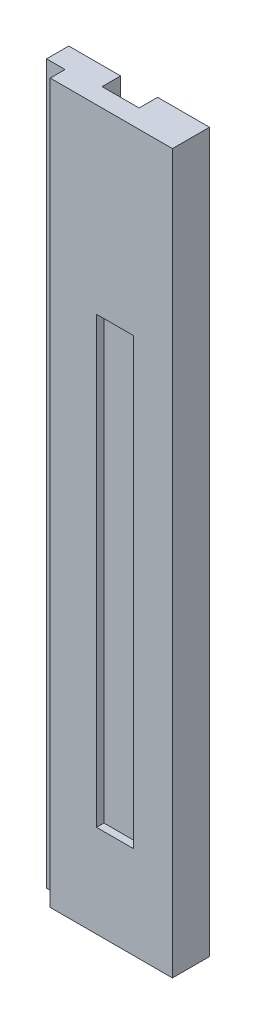
ISO-10303-21;
HEADER;
FILE_DESCRIPTION(('STEP AP214'),'2;1');
FILE_NAME('part.step','',(''),(''),'','','');
FILE_SCHEMA(('AUTOMOTIVE_DESIGN { 1 0 10303 214 1 1 1 1 }'));
ENDSEC;
DATA;
#1=APPLICATION_CONTEXT('core data for automotive mechanical design processes');
#2=APPLICATION_PROTOCOL_DEFINITION('international standard','automotive_design',2000,#1);
#3=PRODUCT_CONTEXT('',#1,'mechanical');
#4=PRODUCT('Part','Part','',(#3));
#5=PRODUCT_RELATED_PRODUCT_CATEGORY('part','',(#4));
#6=PRODUCT_DEFINITION_FORMATION('','',#4);
#7=PRODUCT_DEFINITION_CONTEXT('part definition',#1,'design');
#8=PRODUCT_DEFINITION('design','',#6,#7);
#9=PRODUCT_DEFINITION_SHAPE('','',#8);
#10=(LENGTH_UNIT() NAMED_UNIT(*) SI_UNIT(.MILLI.,.METRE.));
#11=(NAMED_UNIT(*) PLANE_ANGLE_UNIT() SI_UNIT($,.RADIAN.));
#12=(NAMED_UNIT(*) SI_UNIT($,.STERADIAN.) SOLID_ANGLE_UNIT());
#13=UNCERTAINTY_MEASURE_WITH_UNIT(LENGTH_MEASURE(1.E-05),#10,'distance_accuracy_value','');
#14=(GEOMETRIC_REPRESENTATION_CONTEXT(3) GLOBAL_UNCERTAINTY_ASSIGNED_CONTEXT((#13)) GLOBAL_UNIT_ASSIGNED_CONTEXT((#10,
#11,#12)) REPRESENTATION_CONTEXT('',''));
#15=CARTESIAN_POINT('',(0.,0.,0.));
#16=DIRECTION('',(0.,0.,1.));
#17=DIRECTION('',(1.,0.,0.));
#18=AXIS2_PLACEMENT_3D('',#15,#16,#17);
#19=CARTESIAN_POINT('',(0.,0.,-1.));
#20=DIRECTION('',(0.,0.,-1.));
#21=DIRECTION('',(-1.,0.,0.));
#22=AXIS2_PLACEMENT_3D('',#19,#20,#21);
#23=PLANE('',#22);
#24=DIRECTION('',(1.,0.,0.));
#25=VECTOR('',#24,1.);
#26=CARTESIAN_POINT('',(5.00000000000001,-61.0282681743026,-1.));
#27=LINE('',#26,#25);
#28=CARTESIAN_POINT('',(-5.,-61.0282681743026,-1.));
#29=VERTEX_POINT('',#28);
#30=CARTESIAN_POINT('',(5.00000000000001,-61.0282681743026,-1.));
#31=VERTEX_POINT('',#30);
#32=EDGE_CURVE('E208',#29,#31,#27,.T.);
#33=ORIENTED_EDGE('',*,*,#32,.F.);
#34=DIRECTION('',(0.,-1.,0.));
#35=VECTOR('',#34,1.);
#36=CARTESIAN_POINT('',(-5.,108.971731825697,-1.));
#37=LINE('',#36,#35);
#38=CARTESIAN_POINT('',(-5.,132.971731825697,-1.));
#39=VERTEX_POINT('',#38);
#40=EDGE_CURVE('E240',#39,#29,#37,.T.);
#41=ORIENTED_EDGE('',*,*,#40,.F.);
#42=DIRECTION('',(-1.,0.,0.));
#43=VECTOR('',#42,1.);
#44=CARTESIAN_POINT('',(-5.,132.971731825697,-1.));
#45=LINE('',#44,#43);
#46=CARTESIAN_POINT('',(5.00000000000001,132.971731825697,-1.));
#47=VERTEX_POINT('',#46);
#48=EDGE_CURVE('E193',#47,#39,#45,.T.);
#49=ORIENTED_EDGE('',*,*,#48,.F.);
#50=DIRECTION('',(0.,1.,0.));
#51=VECTOR('',#50,1.);
#52=CARTESIAN_POINT('',(5.,-61.0282681743026,-1.));
#53=LINE('',#52,#51);
#54=EDGE_CURVE('E244',#31,#47,#53,.T.);
#55=ORIENTED_EDGE('',*,*,#54,.F.);
#56=EDGE_LOOP('',(#33,#41,#49,#55));
#57=FACE_BOUND('',#56,.T.);
#58=ADVANCED_FACE('F43',(#57),#23,.T.);
#59=CARTESIAN_POINT('',(0.,0.,4.));
#60=DIRECTION('',(0.,0.,-1.));
#61=DIRECTION('',(-1.,0.,0.));
#62=AXIS2_PLACEMENT_3D('',#59,#60,#61);
#63=PLANE('',#62);
#64=DIRECTION('',(1.,0.,0.));
#65=VECTOR('',#64,1.);
#66=CARTESIAN_POINT('',(-1.50000000000002,-36.0282681743026,4.));
#67=LINE('',#66,#65);
#68=CARTESIAN_POINT('',(-1.50000000000002,-36.0282681743026,4.));
#69=VERTEX_POINT('',#68);
#70=CARTESIAN_POINT('',(8.49999999999998,-36.0282681743026,4.));
#71=VERTEX_POINT('',#70);
#72=EDGE_CURVE('E273',#69,#71,#67,.T.);
#73=ORIENTED_EDGE('',*,*,#72,.F.);
#74=DIRECTION('',(0.,-1.,0.));
#75=VECTOR('',#74,1.);
#76=CARTESIAN_POINT('',(-1.50000000000004,83.9717318256974,4.));
#77=LINE('',#76,#75);
#78=CARTESIAN_POINT('',(-1.50000000000004,83.9717318256974,4.));
#79=VERTEX_POINT('',#78);
#80=EDGE_CURVE('E66',#79,#69,#77,.T.);
#81=ORIENTED_EDGE('',*,*,#80,.F.);
#82=DIRECTION('',(-1.,0.,0.));
#83=VECTOR('',#82,1.);
#84=CARTESIAN_POINT('',(-1.50000000000004,83.9717318256974,4.));
#85=LINE('',#84,#83);
#86=CARTESIAN_POINT('',(8.49999999999996,83.9717318256974,4.));
#87=VERTEX_POINT('',#86);
#88=EDGE_CURVE('E258',#87,#79,#85,.T.);
#89=ORIENTED_EDGE('',*,*,#88,.F.);
#90=DIRECTION('',(0.,1.,0.));
#91=VECTOR('',#90,1.);
#92=CARTESIAN_POINT('',(8.49999999999996,83.9717318256974,4.));
#93=LINE('',#92,#91);
#94=EDGE_CURVE('E277',#71,#87,#93,.T.);
#95=ORIENTED_EDGE('',*,*,#94,.F.);
#96=EDGE_LOOP('',(#73,#81,#89,#95));
#97=FACE_BOUND('',#96,.T.);
#98=DIRECTION('',(0.,1.,0.));
#99=VECTOR('',#98,1.);
#100=CARTESIAN_POINT('',(-14.,-31.0282681743026,4.));
#101=LINE('',#100,#99);
#102=CARTESIAN_POINT('',(-14.,-61.0282681743026,4.));
#103=VERTEX_POINT('',#102);
#104=CARTESIAN_POINT('',(-14.,132.971731825697,4.));
#105=VERTEX_POINT('',#104);
#106=EDGE_CURVE('E46',#103,#105,#101,.T.);
#107=ORIENTED_EDGE('',*,*,#106,.F.);
#108=DIRECTION('',(-1.,0.,0.));
#109=VECTOR('',#108,1.);
#110=CARTESIAN_POINT('',(-14.,-61.0282681743026,4.));
#111=LINE('',#110,#109);
#112=CARTESIAN_POINT('',(19.,-61.0282681743026,4.));
#113=VERTEX_POINT('',#112);
#114=EDGE_CURVE('E219',#113,#103,#111,.T.);
#115=ORIENTED_EDGE('',*,*,#114,.F.);
#116=DIRECTION('',(0.,-1.,0.));
#117=VECTOR('',#116,1.);
#118=CARTESIAN_POINT('',(19.,-61.0282681743026,4.));
#119=LINE('',#118,#117);
#120=CARTESIAN_POINT('',(19.,132.971731825697,4.));
#121=VERTEX_POINT('',#120);
#122=EDGE_CURVE('E234',#121,#113,#119,.T.);
#123=ORIENTED_EDGE('',*,*,#122,.F.);
#124=DIRECTION('',(1.,0.,0.));
#125=VECTOR('',#124,1.);
#126=CARTESIAN_POINT('',(19.,132.971731825697,4.));
#127=LINE('',#126,#125);
#128=EDGE_CURVE('E177',#105,#121,#127,.T.);
#129=ORIENTED_EDGE('',*,*,#128,.F.);
#130=EDGE_LOOP('',(#107,#115,#123,#129));
#131=FACE_BOUND('',#130,.T.);
#132=ADVANCED_FACE('F301',(#97,#131),#63,.F.);
#133=CARTESIAN_POINT('',(-21.,-31.0282681743026,0.));
#134=DIRECTION('',(0.,0.,-1.));
#135=DIRECTION('',(-1.,0.,0.));
#136=AXIS2_PLACEMENT_3D('',#133,#134,#135);
#137=PLANE('',#136);
#138=DIRECTION('',(0.,-1.,0.));
#139=VECTOR('',#138,1.);
#140=CARTESIAN_POINT('',(-19.,-31.0282681743026,0.));
#141=LINE('',#140,#139);
#142=CARTESIAN_POINT('',(-19.,132.971731825697,0.));
#143=VERTEX_POINT('',#142);
#144=CARTESIAN_POINT('',(-19.,-61.0282681743026,0.));
#145=VERTEX_POINT('',#144);
#146=EDGE_CURVE('E144',#143,#145,#141,.T.);
#147=ORIENTED_EDGE('',*,*,#146,.T.);
#148=DIRECTION('',(-1.,0.,0.));
#149=VECTOR('',#148,1.);
#150=CARTESIAN_POINT('',(-19.,-61.0282681743026,0.));
#151=LINE('',#150,#149);
#152=CARTESIAN_POINT('',(-14.,-61.0282681743026,0.));
#153=VERTEX_POINT('',#152);
#154=EDGE_CURVE('E225',#153,#145,#151,.T.);
#155=ORIENTED_EDGE('',*,*,#154,.F.);
#156=DIRECTION('',(0.,1.,0.));
#157=VECTOR('',#156,1.);
#158=CARTESIAN_POINT('',(-14.,-31.0282681743026,0.));
#159=LINE('',#158,#157);
#160=CARTESIAN_POINT('',(-14.,132.971731825697,0.));
#161=VERTEX_POINT('',#160);
#162=EDGE_CURVE('E11',#153,#161,#159,.T.);
#163=ORIENTED_EDGE('',*,*,#162,.T.);
#164=DIRECTION('',(1.,0.,0.));
#165=VECTOR('',#164,1.);
#166=CARTESIAN_POINT('',(-14.,132.971731825697,0.));
#167=LINE('',#166,#165);
#168=EDGE_CURVE('E158',#143,#161,#167,.T.);
#169=ORIENTED_EDGE('',*,*,#168,.F.);
#170=EDGE_LOOP('',(#147,#155,#163,#169));
#171=FACE_BOUND('',#170,.T.);
#172=ADVANCED_FACE('F159',(#171),#137,.F.);
#173=CARTESIAN_POINT('',(-14.,-31.0282681743026,0.));
#174=DIRECTION('',(1.,0.,0.));
#175=DIRECTION('',(0.,0.,-1.));
#176=AXIS2_PLACEMENT_3D('',#173,#174,#175);
#177=PLANE('',#176);
#178=ORIENTED_EDGE('',*,*,#162,.F.);
#179=DIRECTION('',(0.,0.,-1.));
#180=VECTOR('',#179,1.);
#181=CARTESIAN_POINT('',(-14.,-61.0282681743026,0.));
#182=LINE('',#181,#180);
#183=EDGE_CURVE('E222',#103,#153,#182,.T.);
#184=ORIENTED_EDGE('',*,*,#183,.F.);
#185=ORIENTED_EDGE('',*,*,#106,.T.);
#186=DIRECTION('',(0.,0.,1.));
#187=VECTOR('',#186,1.);
#188=CARTESIAN_POINT('',(-14.,132.971731825697,4.));
#189=LINE('',#188,#187);
#190=EDGE_CURVE('E165',#161,#105,#189,.T.);
#191=ORIENTED_EDGE('',*,*,#190,.F.);
#192=EDGE_LOOP('',(#178,#184,#185,#191));
#193=FACE_BOUND('',#192,.T.);
#194=ADVANCED_FACE('F320',(#193),#177,.F.);
#195=CARTESIAN_POINT('',(-1.50000000000004,83.9717318256974,2.));
#196=DIRECTION('',(-1.,0.,0.));
#197=DIRECTION('',(0.,-1.,0.));
#198=AXIS2_PLACEMENT_3D('',#195,#196,#197);
#199=PLANE('',#198);
#200=ORIENTED_EDGE('',*,*,#80,.T.);
#201=DIRECTION('',(0.,0.,1.));
#202=VECTOR('',#201,1.);
#203=CARTESIAN_POINT('',(-1.50000000000002,-36.0282681743026,2.));
#204=LINE('',#203,#202);
#205=CARTESIAN_POINT('',(-1.50000000000002,-36.0282681743026,2.));
#206=VERTEX_POINT('',#205);
#207=EDGE_CURVE('E270',#206,#69,#204,.T.);
#208=ORIENTED_EDGE('',*,*,#207,.F.);
#209=DIRECTION('',(0.,-1.,0.));
#210=VECTOR('',#209,1.);
#211=CARTESIAN_POINT('',(-1.50000000000004,83.9717318256974,2.));
#212=LINE('',#211,#210);
#213=CARTESIAN_POINT('',(-1.50000000000004,83.9717318256974,2.));
#214=VERTEX_POINT('',#213);
#215=EDGE_CURVE('E253',#214,#206,#212,.T.);
#216=ORIENTED_EDGE('',*,*,#215,.F.);
#217=DIRECTION('',(0.,0.,1.));
#218=VECTOR('',#217,1.);
#219=CARTESIAN_POINT('',(-1.50000000000004,83.9717318256974,2.));
#220=LINE('',#219,#218);
#221=EDGE_CURVE('E284',#214,#79,#220,.T.);
#222=ORIENTED_EDGE('',*,*,#221,.T.);
#223=EDGE_LOOP('',(#200,#208,#216,#222));
#224=FACE_BOUND('',#223,.T.);
#225=ADVANCED_FACE('F310',(#224),#199,.F.);
#226=CARTESIAN_POINT('',(-1.50000000000004,83.9717318256974,2.));
#227=DIRECTION('',(0.,1.,0.));
#228=DIRECTION('',(0.,0.,1.));
#229=AXIS2_PLACEMENT_3D('',#226,#227,#228);
#230=PLANE('',#229);
#231=ORIENTED_EDGE('',*,*,#88,.T.);
#232=ORIENTED_EDGE('',*,*,#221,.F.);
#233=DIRECTION('',(-1.,0.,0.));
#234=VECTOR('',#233,1.);
#235=CARTESIAN_POINT('',(-1.50000000000004,83.9717318256974,2.));
#236=LINE('',#235,#234);
#237=CARTESIAN_POINT('',(8.49999999999996,83.9717318256974,2.));
#238=VERTEX_POINT('',#237);
#239=EDGE_CURVE('E266',#238,#214,#236,.T.);
#240=ORIENTED_EDGE('',*,*,#239,.F.);
#241=DIRECTION('',(0.,0.,1.));
#242=VECTOR('',#241,1.);
#243=CARTESIAN_POINT('',(8.49999999999996,83.9717318256974,2.));
#244=LINE('',#243,#242);
#245=EDGE_CURVE('E287',#238,#87,#244,.T.);
#246=ORIENTED_EDGE('',*,*,#245,.T.);
#247=EDGE_LOOP('',(#231,#232,#240,#246));
#248=FACE_BOUND('',#247,.T.);
#249=ADVANCED_FACE('F312',(#248),#230,.F.);
#250=CARTESIAN_POINT('',(8.49999999999996,83.9717318256974,2.));
#251=DIRECTION('',(1.,0.,0.));
#252=DIRECTION('',(0.,1.,0.));
#253=AXIS2_PLACEMENT_3D('',#250,#251,#252);
#254=PLANE('',#253);
#255=ORIENTED_EDGE('',*,*,#94,.T.);
#256=ORIENTED_EDGE('',*,*,#245,.F.);
#257=DIRECTION('',(0.,1.,0.));
#258=VECTOR('',#257,1.);
#259=CARTESIAN_POINT('',(8.49999999999996,83.9717318256974,2.));
#260=LINE('',#259,#258);
#261=CARTESIAN_POINT('',(8.49999999999998,-36.0282681743026,2.));
#262=VERTEX_POINT('',#261);
#263=EDGE_CURVE('E262',#262,#238,#260,.T.);
#264=ORIENTED_EDGE('',*,*,#263,.F.);
#265=DIRECTION('',(0.,0.,1.));
#266=VECTOR('',#265,1.);
#267=CARTESIAN_POINT('',(8.49999999999998,-36.0282681743026,2.));
#268=LINE('',#267,#266);
#269=EDGE_CURVE('E290',#262,#71,#268,.T.);
#270=ORIENTED_EDGE('',*,*,#269,.T.);
#271=EDGE_LOOP('',(#255,#256,#264,#270));
#272=FACE_BOUND('',#271,.T.);
#273=ADVANCED_FACE('F305',(#272),#254,.F.);
#274=CARTESIAN_POINT('',(-1.50000000000002,-36.0282681743026,2.));
#275=DIRECTION('',(0.,-1.,0.));
#276=DIRECTION('',(0.,0.,-1.));
#277=AXIS2_PLACEMENT_3D('',#274,#275,#276);
#278=PLANE('',#277);
#279=ORIENTED_EDGE('',*,*,#72,.T.);
#280=ORIENTED_EDGE('',*,*,#269,.F.);
#281=DIRECTION('',(1.,0.,0.));
#282=VECTOR('',#281,1.);
#283=CARTESIAN_POINT('',(-1.50000000000002,-36.0282681743026,2.));
#284=LINE('',#283,#282);
#285=EDGE_CURVE('E257',#206,#262,#284,.T.);
#286=ORIENTED_EDGE('',*,*,#285,.F.);
#287=ORIENTED_EDGE('',*,*,#207,.T.);
#288=EDGE_LOOP('',(#279,#280,#286,#287));
#289=FACE_BOUND('',#288,.T.);
#290=ADVANCED_FACE('F297',(#289),#278,.F.);
#291=CARTESIAN_POINT('',(0.,0.,2.));
#292=DIRECTION('',(0.,0.,1.));
#293=DIRECTION('',(1.,0.,0.));
#294=AXIS2_PLACEMENT_3D('',#291,#292,#293);
#295=PLANE('',#294);
#296=ORIENTED_EDGE('',*,*,#215,.T.);
#297=ORIENTED_EDGE('',*,*,#285,.T.);
#298=ORIENTED_EDGE('',*,*,#263,.T.);
#299=ORIENTED_EDGE('',*,*,#239,.T.);
#300=EDGE_LOOP('',(#296,#297,#298,#299));
#301=FACE_BOUND('',#300,.T.);
#302=ADVANCED_FACE('F309',(#301),#295,.T.);
#303=CARTESIAN_POINT('',(5.,-61.0282681743026,-6.));
#304=DIRECTION('',(1.,0.,0.));
#305=DIRECTION('',(0.,1.,0.));
#306=AXIS2_PLACEMENT_3D('',#303,#304,#305);
#307=PLANE('',#306);
#308=DIRECTION('',(0.,1.,0.));
#309=VECTOR('',#308,1.);
#310=CARTESIAN_POINT('',(5.,-61.0282681743026,-6.));
#311=LINE('',#310,#309);
#312=CARTESIAN_POINT('',(5.00000000000001,-61.0282681743026,-6.));
#313=VERTEX_POINT('',#312);
#314=CARTESIAN_POINT('',(5.00000000000001,132.971731825697,-6.));
#315=VERTEX_POINT('',#314);
#316=EDGE_CURVE('E248',#313,#315,#311,.T.);
#317=ORIENTED_EDGE('',*,*,#316,.F.);
#318=DIRECTION('',(0.,0.,-1.));
#319=VECTOR('',#318,1.);
#320=CARTESIAN_POINT('',(5.00000000000001,-61.0282681743026,-6.));
#321=LINE('',#320,#319);
#322=EDGE_CURVE('E211',#31,#313,#321,.T.);
#323=ORIENTED_EDGE('',*,*,#322,.F.);
#324=ORIENTED_EDGE('',*,*,#54,.T.);
#325=DIRECTION('',(0.,0.,1.));
#326=VECTOR('',#325,1.);
#327=CARTESIAN_POINT('',(5.00000000000001,132.971731825697,-1.));
#328=LINE('',#327,#326);
#329=EDGE_CURVE('E189',#315,#47,#328,.T.);
#330=ORIENTED_EDGE('',*,*,#329,.F.);
#331=EDGE_LOOP('',(#317,#323,#324,#330));
#332=FACE_BOUND('',#331,.T.);
#333=ADVANCED_FACE('F355',(#332),#307,.F.);
#334=CARTESIAN_POINT('',(0.,0.,-6.));
#335=DIRECTION('',(0.,0.,1.));
#336=DIRECTION('',(1.,0.,0.));
#337=AXIS2_PLACEMENT_3D('',#334,#335,#336);
#338=PLANE('',#337);
#339=DIRECTION('',(0.,-1.,0.));
#340=VECTOR('',#339,1.);
#341=CARTESIAN_POINT('',(19.,-61.0282681743026,-6.));
#342=LINE('',#341,#340);
#343=CARTESIAN_POINT('',(19.,132.971731825697,-6.));
#344=VERTEX_POINT('',#343);
#345=CARTESIAN_POINT('',(19.,-61.0282681743026,-6.));
#346=VERTEX_POINT('',#345);
#347=EDGE_CURVE('E155',#344,#346,#342,.T.);
#348=ORIENTED_EDGE('',*,*,#347,.T.);
#349=DIRECTION('',(1.,0.,0.));
#350=VECTOR('',#349,1.);
#351=CARTESIAN_POINT('',(19.,-61.0282681743026,-6.));
#352=LINE('',#351,#350);
#353=EDGE_CURVE('E58',#313,#346,#352,.T.);
#354=ORIENTED_EDGE('',*,*,#353,.F.);
#355=ORIENTED_EDGE('',*,*,#316,.T.);
#356=DIRECTION('',(-1.,0.,0.));
#357=VECTOR('',#356,1.);
#358=CARTESIAN_POINT('',(5.00000000000001,132.971731825697,-6.));
#359=LINE('',#358,#357);
#360=EDGE_CURVE('E185',#344,#315,#359,.T.);
#361=ORIENTED_EDGE('',*,*,#360,.F.);
#362=EDGE_LOOP('',(#348,#354,#355,#361));
#363=FACE_BOUND('',#362,.T.);
#364=ADVANCED_FACE('F352',(#363),#338,.F.);
#365=CARTESIAN_POINT('',(-5.,108.971731825697,-6.));
#366=DIRECTION('',(-1.,0.,0.));
#367=DIRECTION('',(0.,0.,1.));
#368=AXIS2_PLACEMENT_3D('',#365,#366,#367);
#369=PLANE('',#368);
#370=ORIENTED_EDGE('',*,*,#40,.T.);
#371=DIRECTION('',(0.,0.,1.));
#372=VECTOR('',#371,1.);
#373=CARTESIAN_POINT('',(-5.,-61.0282681743026,-1.));
#374=LINE('',#373,#372);
#375=CARTESIAN_POINT('',(-5.,-61.0282681743026,-6.));
#376=VERTEX_POINT('',#375);
#377=EDGE_CURVE('E205',#376,#29,#374,.T.);
#378=ORIENTED_EDGE('',*,*,#377,.F.);
#379=DIRECTION('',(0.,-1.,0.));
#380=VECTOR('',#379,1.);
#381=CARTESIAN_POINT('',(-5.,108.971731825697,-6.));
#382=LINE('',#381,#380);
#383=CARTESIAN_POINT('',(-5.,132.971731825697,-6.));
#384=VERTEX_POINT('',#383);
#385=EDGE_CURVE('E154',#384,#376,#382,.T.);
#386=ORIENTED_EDGE('',*,*,#385,.F.);
#387=DIRECTION('',(0.,0.,-1.));
#388=VECTOR('',#387,1.);
#389=CARTESIAN_POINT('',(-5.,132.971731825697,-6.));
#390=LINE('',#389,#388);
#391=EDGE_CURVE('E197',#39,#384,#390,.T.);
#392=ORIENTED_EDGE('',*,*,#391,.F.);
#393=EDGE_LOOP('',(#370,#378,#386,#392));
#394=FACE_BOUND('',#393,.T.);
#395=ADVANCED_FACE('F336',(#394),#369,.F.);
#396=CARTESIAN_POINT('',(0.,0.,-6.));
#397=DIRECTION('',(0.,0.,-1.));
#398=DIRECTION('',(-1.,0.,0.));
#399=AXIS2_PLACEMENT_3D('',#396,#397,#398);
#400=PLANE('',#399);
#401=DIRECTION('',(1.,0.,0.));
#402=VECTOR('',#401,1.);
#403=CARTESIAN_POINT('',(-5.,-61.0282681743026,-6.));
#404=LINE('',#403,#402);
#405=CARTESIAN_POINT('',(-19.,-61.0282681743026,-6.));
#406=VERTEX_POINT('',#405);
#407=EDGE_CURVE('E202',#406,#376,#404,.T.);
#408=ORIENTED_EDGE('',*,*,#407,.F.);
#409=DIRECTION('',(0.,1.,0.));
#410=VECTOR('',#409,1.);
#411=CARTESIAN_POINT('',(-19.,108.971731825697,-6.));
#412=LINE('',#411,#410);
#413=CARTESIAN_POINT('',(-19.,132.971731825697,-6.));
#414=VERTEX_POINT('',#413);
#415=EDGE_CURVE('E230',#406,#414,#412,.T.);
#416=ORIENTED_EDGE('',*,*,#415,.T.);
#417=DIRECTION('',(-1.,0.,0.));
#418=VECTOR('',#417,1.);
#419=CARTESIAN_POINT('',(-19.,132.971731825697,-6.));
#420=LINE('',#419,#418);
#421=EDGE_CURVE('E171',#384,#414,#420,.T.);
#422=ORIENTED_EDGE('',*,*,#421,.F.);
#423=ORIENTED_EDGE('',*,*,#385,.T.);
#424=EDGE_LOOP('',(#408,#416,#422,#423));
#425=FACE_BOUND('',#424,.T.);
#426=ADVANCED_FACE('F339',(#425),#400,.T.);
#427=CARTESIAN_POINT('',(-19.,108.971731825697,-6.));
#428=DIRECTION('',(1.,0.,0.));
#429=DIRECTION('',(0.,1.,0.));
#430=AXIS2_PLACEMENT_3D('',#427,#428,#429);
#431=PLANE('',#430);
#432=ORIENTED_EDGE('',*,*,#415,.F.);
#433=DIRECTION('',(0.,0.,-1.));
#434=VECTOR('',#433,1.);
#435=CARTESIAN_POINT('',(-19.,-61.0282681743026,-6.));
#436=LINE('',#435,#434);
#437=EDGE_CURVE('E150',#145,#406,#436,.T.);
#438=ORIENTED_EDGE('',*,*,#437,.F.);
#439=ORIENTED_EDGE('',*,*,#146,.F.);
#440=DIRECTION('',(0.,0.,1.));
#441=VECTOR('',#440,1.);
#442=CARTESIAN_POINT('',(-19.,132.971731825697,0.));
#443=LINE('',#442,#441);
#444=EDGE_CURVE('E149',#414,#143,#443,.T.);
#445=ORIENTED_EDGE('',*,*,#444,.F.);
#446=EDGE_LOOP('',(#432,#438,#439,#445));
#447=FACE_BOUND('',#446,.T.);
#448=ADVANCED_FACE('F147',(#447),#431,.F.);
#449=CARTESIAN_POINT('',(19.,-61.0282681743026,-6.));
#450=DIRECTION('',(-1.,0.,0.));
#451=DIRECTION('',(0.,0.,1.));
#452=AXIS2_PLACEMENT_3D('',#449,#450,#451);
#453=PLANE('',#452);
#454=ORIENTED_EDGE('',*,*,#122,.T.);
#455=DIRECTION('',(0.,0.,1.));
#456=VECTOR('',#455,1.);
#457=CARTESIAN_POINT('',(19.,-61.0282681743026,4.));
#458=LINE('',#457,#456);
#459=EDGE_CURVE('E216',#346,#113,#458,.T.);
#460=ORIENTED_EDGE('',*,*,#459,.F.);
#461=ORIENTED_EDGE('',*,*,#347,.F.);
#462=DIRECTION('',(0.,0.,-1.));
#463=VECTOR('',#462,1.);
#464=CARTESIAN_POINT('',(19.,132.971731825697,-6.));
#465=LINE('',#464,#463);
#466=EDGE_CURVE('E181',#121,#344,#465,.T.);
#467=ORIENTED_EDGE('',*,*,#466,.F.);
#468=EDGE_LOOP('',(#454,#460,#461,#467));
#469=FACE_BOUND('',#468,.T.);
#470=ADVANCED_FACE('F348',(#469),#453,.F.);
#471=CARTESIAN_POINT('',(0.,-61.0282681743026,0.));
#472=DIRECTION('',(0.,1.,0.));
#473=DIRECTION('',(0.,0.,1.));
#474=AXIS2_PLACEMENT_3D('',#471,#472,#473);
#475=PLANE('',#474);
#476=ORIENTED_EDGE('',*,*,#407,.T.);
#477=ORIENTED_EDGE('',*,*,#377,.T.);
#478=ORIENTED_EDGE('',*,*,#32,.T.);
#479=ORIENTED_EDGE('',*,*,#322,.T.);
#480=ORIENTED_EDGE('',*,*,#353,.T.);
#481=ORIENTED_EDGE('',*,*,#459,.T.);
#482=ORIENTED_EDGE('',*,*,#114,.T.);
#483=ORIENTED_EDGE('',*,*,#183,.T.);
#484=ORIENTED_EDGE('',*,*,#154,.T.);
#485=ORIENTED_EDGE('',*,*,#437,.T.);
#486=EDGE_LOOP('',(#476,#477,#478,#479,#480,#481,#482,#483,#484,#485));
#487=FACE_BOUND('',#486,.T.);
#488=ADVANCED_FACE('F340',(#487),#475,.F.);
#489=CARTESIAN_POINT('',(0.,132.971731825697,0.));
#490=DIRECTION('',(0.,-1.,0.));
#491=DIRECTION('',(0.,0.,-1.));
#492=AXIS2_PLACEMENT_3D('',#489,#490,#491);
#493=PLANE('',#492);
#494=ORIENTED_EDGE('',*,*,#444,.T.);
#495=ORIENTED_EDGE('',*,*,#168,.T.);
#496=ORIENTED_EDGE('',*,*,#190,.T.);
#497=ORIENTED_EDGE('',*,*,#128,.T.);
#498=ORIENTED_EDGE('',*,*,#466,.T.);
#499=ORIENTED_EDGE('',*,*,#360,.T.);
#500=ORIENTED_EDGE('',*,*,#329,.T.);
#501=ORIENTED_EDGE('',*,*,#48,.T.);
#502=ORIENTED_EDGE('',*,*,#391,.T.);
#503=ORIENTED_EDGE('',*,*,#421,.T.);
#504=EDGE_LOOP('',(#494,#495,#496,#497,#498,#499,#500,#501,#502,#503));
#505=FACE_BOUND('',#504,.T.);
#506=ADVANCED_FACE('F168',(#505),#493,.F.);
#507=CLOSED_SHELL('',(#58,#132,#172,#194,#225,#249,#273,#290,#302,#333,#364,#395,#426,#448,#470,
#488,#506));
#508=MANIFOLD_SOLID_BREP('B2',#507);
#509=ADVANCED_BREP_SHAPE_REPRESENTATION('',(#18,#508),#14);
#510=SHAPE_DEFINITION_REPRESENTATION(#9,#509);
ENDSEC;
END-ISO-10303-21;
